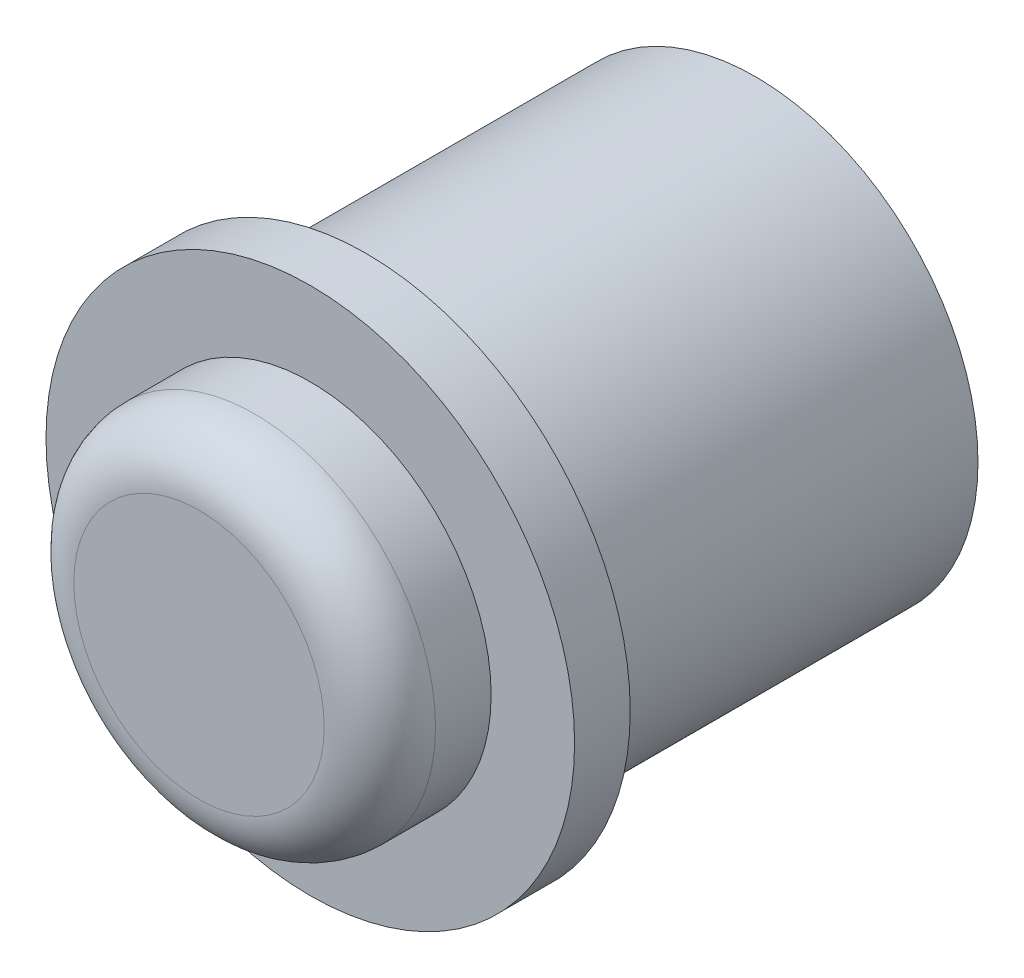
ISO-10303-21;
HEADER;
FILE_DESCRIPTION(('STEP AP214'),'2;1');
FILE_NAME('part.step','',(''),(''),'','','');
FILE_SCHEMA(('AUTOMOTIVE_DESIGN { 1 0 10303 214 1 1 1 1 }'));
ENDSEC;
DATA;
#1=APPLICATION_CONTEXT('core data for automotive mechanical design processes');
#2=APPLICATION_PROTOCOL_DEFINITION('international standard','automotive_design',2000,#1);
#3=PRODUCT_CONTEXT('',#1,'mechanical');
#4=PRODUCT('Part','Part','',(#3));
#5=PRODUCT_RELATED_PRODUCT_CATEGORY('part','',(#4));
#6=PRODUCT_DEFINITION_FORMATION('','',#4);
#7=PRODUCT_DEFINITION_CONTEXT('part definition',#1,'design');
#8=PRODUCT_DEFINITION('design','',#6,#7);
#9=PRODUCT_DEFINITION_SHAPE('','',#8);
#10=(LENGTH_UNIT() NAMED_UNIT(*) SI_UNIT(.MILLI.,.METRE.));
#11=(NAMED_UNIT(*) PLANE_ANGLE_UNIT() SI_UNIT($,.RADIAN.));
#12=(NAMED_UNIT(*) SI_UNIT($,.STERADIAN.) SOLID_ANGLE_UNIT());
#13=UNCERTAINTY_MEASURE_WITH_UNIT(LENGTH_MEASURE(1.E-05),#10,'distance_accuracy_value','');
#14=(GEOMETRIC_REPRESENTATION_CONTEXT(3) GLOBAL_UNCERTAINTY_ASSIGNED_CONTEXT((#13)) GLOBAL_UNIT_ASSIGNED_CONTEXT((#10,
#11,#12)) REPRESENTATION_CONTEXT('',''));
#15=CARTESIAN_POINT('',(0.,0.,0.));
#16=DIRECTION('',(0.,0.,1.));
#17=DIRECTION('',(1.,0.,0.));
#18=AXIS2_PLACEMENT_3D('',#15,#16,#17);
#19=CARTESIAN_POINT('',(0.,0.,14.));
#20=DIRECTION('',(0.,0.,-1.));
#21=DIRECTION('',(-1.,0.,0.));
#22=AXIS2_PLACEMENT_3D('',#19,#20,#21);
#23=CYLINDRICAL_SURFACE('',#22,8.);
#24=CARTESIAN_POINT('',(0.,0.,14.));
#25=DIRECTION('',(0.,0.,1.));
#26=DIRECTION('',(1.,0.,0.));
#27=AXIS2_PLACEMENT_3D('',#24,#25,#26);
#28=CIRCLE('',#27,8.);
#29=CARTESIAN_POINT('',(8.,0.,14.));
#30=VERTEX_POINT('',#29);
#31=EDGE_CURVE('E51',#30,#30,#28,.T.);
#32=ORIENTED_EDGE('',*,*,#31,.F.);
#33=EDGE_LOOP('',(#32));
#34=FACE_BOUND('',#33,.T.);
#35=CARTESIAN_POINT('',(0.,0.,0.));
#36=DIRECTION('',(0.,0.,1.));
#37=DIRECTION('',(1.,0.,0.));
#38=AXIS2_PLACEMENT_3D('',#35,#36,#37);
#39=CIRCLE('',#38,8.);
#40=CARTESIAN_POINT('',(8.,0.,0.));
#41=VERTEX_POINT('',#40);
#42=EDGE_CURVE('E54',#41,#41,#39,.T.);
#43=ORIENTED_EDGE('',*,*,#42,.T.);
#44=EDGE_LOOP('',(#43));
#45=FACE_BOUND('',#44,.T.);
#46=ADVANCED_FACE('F36',(#34,#45),#23,.T.);
#47=CARTESIAN_POINT('',(0.,0.,0.));
#48=DIRECTION('',(0.,0.,1.));
#49=DIRECTION('',(1.,0.,0.));
#50=AXIS2_PLACEMENT_3D('',#47,#48,#49);
#51=PLANE('',#50);
#52=ORIENTED_EDGE('',*,*,#42,.F.);
#53=EDGE_LOOP('',(#52));
#54=FACE_BOUND('',#53,.T.);
#55=ADVANCED_FACE('F71',(#54),#51,.F.);
#56=CARTESIAN_POINT('',(0.,0.,16.));
#57=DIRECTION('',(0.,0.,-1.));
#58=DIRECTION('',(-1.,0.,0.));
#59=AXIS2_PLACEMENT_3D('',#56,#57,#58);
#60=CYLINDRICAL_SURFACE('',#59,9.5);
#61=CARTESIAN_POINT('',(0.,0.,16.));
#62=DIRECTION('',(0.,0.,1.));
#63=DIRECTION('',(1.,0.,0.));
#64=AXIS2_PLACEMENT_3D('',#61,#62,#63);
#65=CIRCLE('',#64,9.5);
#66=CARTESIAN_POINT('',(9.5,0.,16.));
#67=VERTEX_POINT('',#66);
#68=EDGE_CURVE('E57',#67,#67,#65,.T.);
#69=ORIENTED_EDGE('',*,*,#68,.F.);
#70=EDGE_LOOP('',(#69));
#71=FACE_BOUND('',#70,.T.);
#72=CARTESIAN_POINT('',(0.,0.,14.));
#73=DIRECTION('',(0.,0.,1.));
#74=DIRECTION('',(1.,0.,0.));
#75=AXIS2_PLACEMENT_3D('',#72,#73,#74);
#76=CIRCLE('',#75,9.5);
#77=CARTESIAN_POINT('',(9.5,0.,14.));
#78=VERTEX_POINT('',#77);
#79=EDGE_CURVE('E60',#78,#78,#76,.T.);
#80=ORIENTED_EDGE('',*,*,#79,.T.);
#81=EDGE_LOOP('',(#80));
#82=FACE_BOUND('',#81,.T.);
#83=ADVANCED_FACE('F68',(#71,#82),#60,.T.);
#84=CARTESIAN_POINT('',(0.,0.,16.));
#85=DIRECTION('',(0.,0.,1.));
#86=DIRECTION('',(1.,0.,0.));
#87=AXIS2_PLACEMENT_3D('',#84,#85,#86);
#88=PLANE('',#87);
#89=CARTESIAN_POINT('',(0.,0.,16.));
#90=DIRECTION('',(0.,0.,1.));
#91=DIRECTION('',(1.,0.,0.));
#92=AXIS2_PLACEMENT_3D('',#89,#90,#91);
#93=CIRCLE('',#92,6.5);
#94=CARTESIAN_POINT('',(6.5,0.,16.));
#95=VERTEX_POINT('',#94);
#96=EDGE_CURVE('E47',#95,#95,#93,.T.);
#97=ORIENTED_EDGE('',*,*,#96,.F.);
#98=EDGE_LOOP('',(#97));
#99=FACE_BOUND('',#98,.T.);
#100=ORIENTED_EDGE('',*,*,#68,.T.);
#101=EDGE_LOOP('',(#100));
#102=FACE_BOUND('',#101,.T.);
#103=ADVANCED_FACE('F66',(#99,#102),#88,.T.);
#104=CARTESIAN_POINT('',(0.,0.,14.));
#105=DIRECTION('',(0.,0.,1.));
#106=DIRECTION('',(1.,0.,0.));
#107=AXIS2_PLACEMENT_3D('',#104,#105,#106);
#108=PLANE('',#107);
#109=ORIENTED_EDGE('',*,*,#31,.T.);
#110=EDGE_LOOP('',(#109));
#111=FACE_BOUND('',#110,.T.);
#112=ORIENTED_EDGE('',*,*,#79,.F.);
#113=EDGE_LOOP('',(#112));
#114=FACE_BOUND('',#113,.T.);
#115=ADVANCED_FACE('F75',(#111,#114),#108,.F.);
#116=CARTESIAN_POINT('',(0.,0.,20.));
#117=DIRECTION('',(0.,0.,-1.));
#118=DIRECTION('',(-1.,0.,0.));
#119=AXIS2_PLACEMENT_3D('',#116,#117,#118);
#120=CYLINDRICAL_SURFACE('',#119,6.5);
#121=CARTESIAN_POINT('',(0.,0.,18.));
#122=DIRECTION('',(0.,0.,1.));
#123=DIRECTION('',(1.,0.,0.));
#124=AXIS2_PLACEMENT_3D('',#121,#122,#123);
#125=CIRCLE('',#124,6.5);
#126=CARTESIAN_POINT('',(6.5,0.,18.));
#127=VERTEX_POINT('',#126);
#128=EDGE_CURVE('E10',#127,#127,#125,.F.);
#129=ORIENTED_EDGE('',*,*,#128,.T.);
#130=EDGE_LOOP('',(#129));
#131=FACE_BOUND('',#130,.T.);
#132=ORIENTED_EDGE('',*,*,#96,.T.);
#133=EDGE_LOOP('',(#132));
#134=FACE_BOUND('',#133,.T.);
#135=ADVANCED_FACE('F77',(#131,#134),#120,.T.);
#136=CARTESIAN_POINT('',(0.,0.,20.));
#137=DIRECTION('',(0.,0.,1.));
#138=DIRECTION('',(1.,0.,0.));
#139=AXIS2_PLACEMENT_3D('',#136,#137,#138);
#140=PLANE('',#139);
#141=CARTESIAN_POINT('',(0.,0.,20.));
#142=DIRECTION('',(0.,0.,1.));
#143=DIRECTION('',(1.,0.,0.));
#144=AXIS2_PLACEMENT_3D('',#141,#142,#143);
#145=CIRCLE('',#144,4.5);
#146=CARTESIAN_POINT('',(4.5,0.,20.));
#147=VERTEX_POINT('',#146);
#148=EDGE_CURVE('E43',#147,#147,#145,.T.);
#149=ORIENTED_EDGE('',*,*,#148,.T.);
#150=EDGE_LOOP('',(#149));
#151=FACE_BOUND('',#150,.T.);
#152=ADVANCED_FACE('F84',(#151),#140,.T.);
#153=CARTESIAN_POINT('',(0.,0.,18.));
#154=DIRECTION('',(0.,0.,1.));
#155=DIRECTION('',(1.,0.,0.));
#156=AXIS2_PLACEMENT_3D('',#153,#154,#155);
#157=TOROIDAL_SURFACE('',#156,4.5,2.);
#158=ORIENTED_EDGE('',*,*,#128,.F.);
#159=EDGE_LOOP('',(#158));
#160=FACE_BOUND('',#159,.T.);
#161=ORIENTED_EDGE('',*,*,#148,.F.);
#162=EDGE_LOOP('',(#161));
#163=FACE_BOUND('',#162,.T.);
#164=ADVANCED_FACE('F38',(#160,#163),#157,.T.);
#165=CLOSED_SHELL('',(#46,#55,#83,#103,#115,#135,#152,#164));
#166=MANIFOLD_SOLID_BREP('B2',#165);
#167=ADVANCED_BREP_SHAPE_REPRESENTATION('',(#18,#166),#14);
#168=SHAPE_DEFINITION_REPRESENTATION(#9,#167);
ENDSEC;
END-ISO-10303-21;
